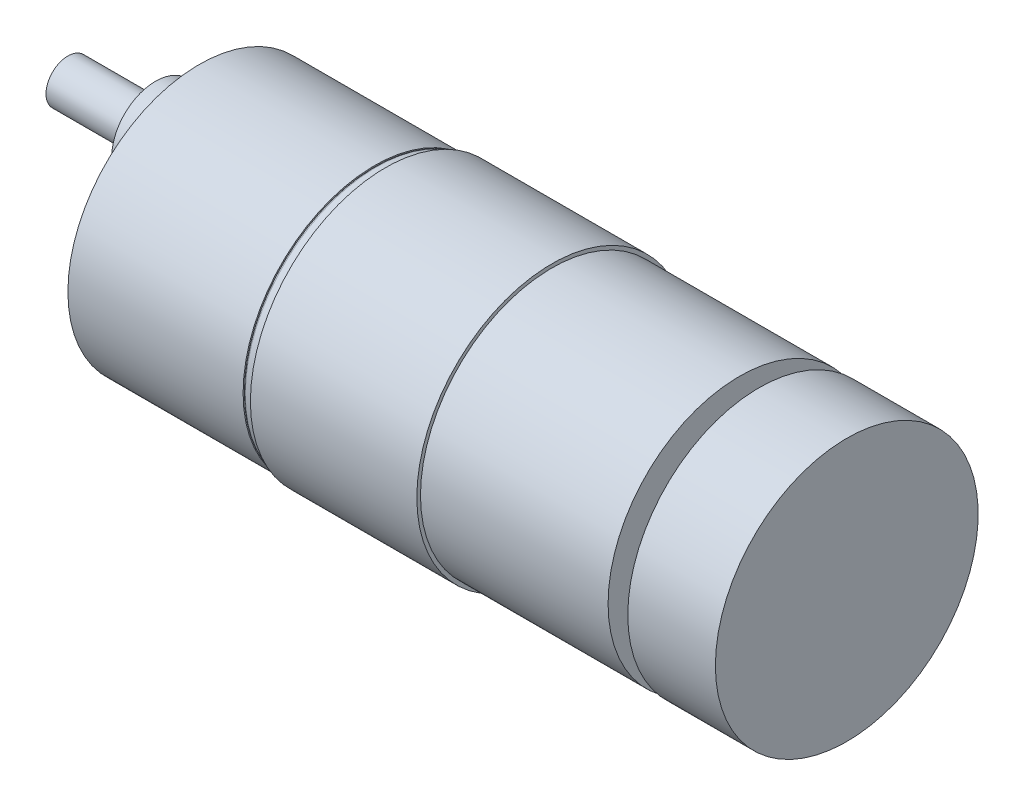
ISO-10303-21;
HEADER;
FILE_DESCRIPTION(('STEP AP214'),'2;1');
FILE_NAME('part.step','',(''),(''),'','','');
FILE_SCHEMA(('AUTOMOTIVE_DESIGN { 1 0 10303 214 1 1 1 1 }'));
ENDSEC;
DATA;
#1=APPLICATION_CONTEXT('core data for automotive mechanical design processes');
#2=APPLICATION_PROTOCOL_DEFINITION('international standard','automotive_design',2000,#1);
#3=PRODUCT_CONTEXT('',#1,'mechanical');
#4=PRODUCT('Part','Part','',(#3));
#5=PRODUCT_RELATED_PRODUCT_CATEGORY('part','',(#4));
#6=PRODUCT_DEFINITION_FORMATION('','',#4);
#7=PRODUCT_DEFINITION_CONTEXT('part definition',#1,'design');
#8=PRODUCT_DEFINITION('design','',#6,#7);
#9=PRODUCT_DEFINITION_SHAPE('','',#8);
#10=(LENGTH_UNIT() NAMED_UNIT(*) SI_UNIT(.MILLI.,.METRE.));
#11=(NAMED_UNIT(*) PLANE_ANGLE_UNIT() SI_UNIT($,.RADIAN.));
#12=(NAMED_UNIT(*) SI_UNIT($,.STERADIAN.) SOLID_ANGLE_UNIT());
#13=UNCERTAINTY_MEASURE_WITH_UNIT(LENGTH_MEASURE(1.E-05),#10,'distance_accuracy_value','');
#14=(GEOMETRIC_REPRESENTATION_CONTEXT(3) GLOBAL_UNCERTAINTY_ASSIGNED_CONTEXT((#13)) GLOBAL_UNIT_ASSIGNED_CONTEXT((#10,
#11,#12)) REPRESENTATION_CONTEXT('',''));
#15=CARTESIAN_POINT('',(0.,0.,0.));
#16=DIRECTION('',(0.,0.,1.));
#17=DIRECTION('',(1.,0.,0.));
#18=AXIS2_PLACEMENT_3D('',#15,#16,#17);
#19=CARTESIAN_POINT('',(0.,0.,0.));
#20=DIRECTION('',(1.,0.,0.));
#21=DIRECTION('',(0.,0.,-1.));
#22=AXIS2_PLACEMENT_3D('',#19,#20,#21);
#23=PLANE('',#22);
#24=CARTESIAN_POINT('',(0.,13.4233937586587,7.75000000000016));
#25=DIRECTION('',(-1.,0.,0.));
#26=DIRECTION('',(0.,0.,1.));
#27=AXIS2_PLACEMENT_3D('',#24,#25,#26);
#28=CIRCLE('',#27,1.5);
#29=CARTESIAN_POINT('',(0.,13.4233937586587,9.25000000000016));
#30=VERTEX_POINT('',#29);
#31=EDGE_CURVE('E127',#30,#30,#28,.T.);
#32=ORIENTED_EDGE('',*,*,#31,.F.);
#33=EDGE_LOOP('',(#32));
#34=FACE_BOUND('',#33,.T.);
#35=CARTESIAN_POINT('',(0.,13.4233937586589,-7.74999999999987));
#36=DIRECTION('',(-1.,0.,0.));
#37=DIRECTION('',(0.,0.,1.));
#38=AXIS2_PLACEMENT_3D('',#35,#36,#37);
#39=CIRCLE('',#38,1.5);
#40=CARTESIAN_POINT('',(0.,13.4233937586589,-6.24999999999987));
#41=VERTEX_POINT('',#40);
#42=EDGE_CURVE('E121',#41,#41,#39,.T.);
#43=ORIENTED_EDGE('',*,*,#42,.F.);
#44=EDGE_LOOP('',(#43));
#45=FACE_BOUND('',#44,.T.);
#46=CARTESIAN_POINT('',(0.,1.08235921504137E-13,-15.5));
#47=DIRECTION('',(-1.,0.,0.));
#48=DIRECTION('',(0.,0.,1.));
#49=AXIS2_PLACEMENT_3D('',#46,#47,#48);
#50=CIRCLE('',#49,1.5);
#51=CARTESIAN_POINT('',(0.,1.08235921504137E-13,-14.));
#52=VERTEX_POINT('',#51);
#53=EDGE_CURVE('E115',#52,#52,#50,.T.);
#54=ORIENTED_EDGE('',*,*,#53,.F.);
#55=EDGE_LOOP('',(#54));
#56=FACE_BOUND('',#55,.T.);
#57=CARTESIAN_POINT('',(0.,-13.4233937586588,-7.75000000000006));
#58=DIRECTION('',(-1.,0.,0.));
#59=DIRECTION('',(0.,0.,1.));
#60=AXIS2_PLACEMENT_3D('',#57,#58,#59);
#61=CIRCLE('',#60,1.5);
#62=CARTESIAN_POINT('',(0.,-13.4233937586588,-6.25000000000006));
#63=VERTEX_POINT('',#62);
#64=EDGE_CURVE('E109',#63,#63,#61,.T.);
#65=ORIENTED_EDGE('',*,*,#64,.F.);
#66=EDGE_LOOP('',(#65));
#67=FACE_BOUND('',#66,.T.);
#68=CARTESIAN_POINT('',(0.,-13.4233937586588,7.74999999999997));
#69=DIRECTION('',(-1.,0.,0.));
#70=DIRECTION('',(0.,0.,1.));
#71=AXIS2_PLACEMENT_3D('',#68,#69,#70);
#72=CIRCLE('',#71,1.5);
#73=CARTESIAN_POINT('',(0.,-13.4233937586588,9.24999999999997));
#74=VERTEX_POINT('',#73);
#75=EDGE_CURVE('E103',#74,#74,#72,.T.);
#76=ORIENTED_EDGE('',*,*,#75,.F.);
#77=EDGE_LOOP('',(#76));
#78=FACE_BOUND('',#77,.T.);
#79=CARTESIAN_POINT('',(0.,0.,15.5));
#80=DIRECTION('',(-1.,0.,0.));
#81=DIRECTION('',(0.,0.,1.));
#82=AXIS2_PLACEMENT_3D('',#79,#80,#81);
#83=CIRCLE('',#82,1.5);
#84=CARTESIAN_POINT('',(0.,0.,17.));
#85=VERTEX_POINT('',#84);
#86=EDGE_CURVE('E97',#85,#85,#83,.T.);
#87=ORIENTED_EDGE('',*,*,#86,.F.);
#88=EDGE_LOOP('',(#87));
#89=FACE_BOUND('',#88,.T.);
#90=CARTESIAN_POINT('',(0.,7.,0.));
#91=DIRECTION('',(1.,0.,0.));
#92=DIRECTION('',(0.,0.,-1.));
#93=AXIS2_PLACEMENT_3D('',#90,#91,#92);
#94=CIRCLE('',#93,6.);
#95=CARTESIAN_POINT('',(0.,7.,-6.));
#96=VERTEX_POINT('',#95);
#97=EDGE_CURVE('E10',#96,#96,#94,.F.);
#98=ORIENTED_EDGE('',*,*,#97,.F.);
#99=EDGE_LOOP('',(#98));
#100=FACE_BOUND('',#99,.T.);
#101=CARTESIAN_POINT('',(0.,0.,0.));
#102=DIRECTION('',(-1.,0.,0.));
#103=DIRECTION('',(0.,0.,1.));
#104=AXIS2_PLACEMENT_3D('',#101,#102,#103);
#105=CIRCLE('',#104,18.);
#106=CARTESIAN_POINT('',(0.,0.,18.));
#107=VERTEX_POINT('',#106);
#108=EDGE_CURVE('E44',#107,#107,#105,.T.);
#109=ORIENTED_EDGE('',*,*,#108,.T.);
#110=EDGE_LOOP('',(#109));
#111=FACE_BOUND('',#110,.T.);
#112=ADVANCED_FACE('F38',(#34,#45,#56,#67,#78,#89,#100,#111),#23,.F.);
#113=CARTESIAN_POINT('',(-65.6790909566948,0.,0.));
#114=DIRECTION('',(-1.,0.,0.));
#115=DIRECTION('',(0.,0.,1.));
#116=AXIS2_PLACEMENT_3D('',#113,#114,#115);
#117=CYLINDRICAL_SURFACE('',#116,18.);
#118=ORIENTED_EDGE('',*,*,#108,.F.);
#119=EDGE_LOOP('',(#118));
#120=FACE_BOUND('',#119,.T.);
#121=CARTESIAN_POINT('',(24.,0.,0.));
#122=DIRECTION('',(-1.,0.,0.));
#123=DIRECTION('',(0.,0.,1.));
#124=AXIS2_PLACEMENT_3D('',#121,#122,#123);
#125=CIRCLE('',#124,18.);
#126=CARTESIAN_POINT('',(24.,0.,18.));
#127=VERTEX_POINT('',#126);
#128=EDGE_CURVE('E48',#127,#127,#125,.T.);
#129=ORIENTED_EDGE('',*,*,#128,.T.);
#130=EDGE_LOOP('',(#129));
#131=FACE_BOUND('',#130,.T.);
#132=ADVANCED_FACE('F144',(#120,#131),#117,.T.);
#133=CARTESIAN_POINT('',(24.,18.,0.));
#134=DIRECTION('',(-1.,0.,0.));
#135=DIRECTION('',(0.,0.,1.));
#136=AXIS2_PLACEMENT_3D('',#133,#134,#135);
#137=PLANE('',#136);
#138=ORIENTED_EDGE('',*,*,#128,.F.);
#139=EDGE_LOOP('',(#138));
#140=FACE_BOUND('',#139,.T.);
#141=CARTESIAN_POINT('',(24.,0.,0.));
#142=DIRECTION('',(-1.,0.,0.));
#143=DIRECTION('',(0.,0.,1.));
#144=AXIS2_PLACEMENT_3D('',#141,#142,#143);
#145=CIRCLE('',#144,17.7);
#146=CARTESIAN_POINT('',(24.,0.,17.7));
#147=VERTEX_POINT('',#146);
#148=EDGE_CURVE('E52',#147,#147,#145,.T.);
#149=ORIENTED_EDGE('',*,*,#148,.T.);
#150=EDGE_LOOP('',(#149));
#151=FACE_BOUND('',#150,.T.);
#152=ADVANCED_FACE('F229',(#140,#151),#137,.F.);
#153=CARTESIAN_POINT('',(24.3,0.,0.));
#154=DIRECTION('',(-1.,0.,0.));
#155=DIRECTION('',(0.,0.,1.));
#156=AXIS2_PLACEMENT_3D('',#153,#154,#155);
#157=TOROIDAL_SURFACE('',#156,17.7,0.300000000000003);
#158=ORIENTED_EDGE('',*,*,#148,.F.);
#159=EDGE_LOOP('',(#158));
#160=FACE_BOUND('',#159,.T.);
#161=CARTESIAN_POINT('',(24.3,0.,0.));
#162=DIRECTION('',(-1.,0.,0.));
#163=DIRECTION('',(0.,0.,1.));
#164=AXIS2_PLACEMENT_3D('',#161,#162,#163);
#165=CIRCLE('',#164,18.);
#166=CARTESIAN_POINT('',(24.3,0.,18.));
#167=VERTEX_POINT('',#166);
#168=EDGE_CURVE('E57',#167,#167,#165,.T.);
#169=ORIENTED_EDGE('',*,*,#168,.T.);
#170=EDGE_LOOP('',(#169));
#171=FACE_BOUND('',#170,.T.);
#172=ADVANCED_FACE('F225',(#160,#171),#157,.T.);
#173=CARTESIAN_POINT('',(-65.6790909566948,0.,0.));
#174=DIRECTION('',(-1.,0.,0.));
#175=DIRECTION('',(0.,0.,1.));
#176=AXIS2_PLACEMENT_3D('',#173,#174,#175);
#177=CYLINDRICAL_SURFACE('',#176,18.);
#178=ORIENTED_EDGE('',*,*,#168,.F.);
#179=EDGE_LOOP('',(#178));
#180=FACE_BOUND('',#179,.T.);
#181=CARTESIAN_POINT('',(25.5,0.,0.));
#182=DIRECTION('',(-1.,0.,0.));
#183=DIRECTION('',(0.,0.,1.));
#184=AXIS2_PLACEMENT_3D('',#181,#182,#183);
#185=CIRCLE('',#184,18.);
#186=CARTESIAN_POINT('',(25.5,0.,18.));
#187=VERTEX_POINT('',#186);
#188=EDGE_CURVE('E60',#187,#187,#185,.T.);
#189=ORIENTED_EDGE('',*,*,#188,.T.);
#190=EDGE_LOOP('',(#189));
#191=FACE_BOUND('',#190,.T.);
#192=ADVANCED_FACE('F221',(#180,#191),#177,.T.);
#193=CARTESIAN_POINT('',(25.5,18.,0.));
#194=DIRECTION('',(1.,0.,0.));
#195=DIRECTION('',(0.,0.,-1.));
#196=AXIS2_PLACEMENT_3D('',#193,#194,#195);
#197=PLANE('',#196);
#198=ORIENTED_EDGE('',*,*,#188,.F.);
#199=EDGE_LOOP('',(#198));
#200=FACE_BOUND('',#199,.T.);
#201=CARTESIAN_POINT('',(25.5,0.,0.));
#202=DIRECTION('',(-1.,0.,0.));
#203=DIRECTION('',(0.,0.,1.));
#204=AXIS2_PLACEMENT_3D('',#201,#202,#203);
#205=CIRCLE('',#204,18.5);
#206=CARTESIAN_POINT('',(25.5,0.,18.5));
#207=VERTEX_POINT('',#206);
#208=EDGE_CURVE('E63',#207,#207,#205,.T.);
#209=ORIENTED_EDGE('',*,*,#208,.T.);
#210=EDGE_LOOP('',(#209));
#211=FACE_BOUND('',#210,.T.);
#212=ADVANCED_FACE('F217',(#200,#211),#197,.F.);
#213=CARTESIAN_POINT('',(-65.6790909566948,0.,0.));
#214=DIRECTION('',(-1.,0.,0.));
#215=DIRECTION('',(0.,0.,1.));
#216=AXIS2_PLACEMENT_3D('',#213,#214,#215);
#217=CYLINDRICAL_SURFACE('',#216,18.5);
#218=ORIENTED_EDGE('',*,*,#208,.F.);
#219=EDGE_LOOP('',(#218));
#220=FACE_BOUND('',#219,.T.);
#221=CARTESIAN_POINT('',(48.3,0.,0.));
#222=DIRECTION('',(-1.,0.,0.));
#223=DIRECTION('',(0.,0.,1.));
#224=AXIS2_PLACEMENT_3D('',#221,#222,#223);
#225=CIRCLE('',#224,18.5);
#226=CARTESIAN_POINT('',(48.3,0.,18.5));
#227=VERTEX_POINT('',#226);
#228=EDGE_CURVE('E66',#227,#227,#225,.T.);
#229=ORIENTED_EDGE('',*,*,#228,.T.);
#230=EDGE_LOOP('',(#229));
#231=FACE_BOUND('',#230,.T.);
#232=ADVANCED_FACE('F213',(#220,#231),#217,.T.);
#233=CARTESIAN_POINT('',(48.3,18.5,0.));
#234=DIRECTION('',(-1.,0.,0.));
#235=DIRECTION('',(0.,0.,1.));
#236=AXIS2_PLACEMENT_3D('',#233,#234,#235);
#237=PLANE('',#236);
#238=ORIENTED_EDGE('',*,*,#228,.F.);
#239=EDGE_LOOP('',(#238));
#240=FACE_BOUND('',#239,.T.);
#241=CARTESIAN_POINT('',(48.3,0.,0.));
#242=DIRECTION('',(-1.,0.,0.));
#243=DIRECTION('',(0.,0.,1.));
#244=AXIS2_PLACEMENT_3D('',#241,#242,#243);
#245=CIRCLE('',#244,18.);
#246=CARTESIAN_POINT('',(48.3,0.,18.));
#247=VERTEX_POINT('',#246);
#248=EDGE_CURVE('E69',#247,#247,#245,.T.);
#249=ORIENTED_EDGE('',*,*,#248,.T.);
#250=EDGE_LOOP('',(#249));
#251=FACE_BOUND('',#250,.T.);
#252=ADVANCED_FACE('F209',(#240,#251),#237,.F.);
#253=CARTESIAN_POINT('',(-65.6790909566948,0.,0.));
#254=DIRECTION('',(-1.,0.,0.));
#255=DIRECTION('',(0.,0.,1.));
#256=AXIS2_PLACEMENT_3D('',#253,#254,#255);
#257=CYLINDRICAL_SURFACE('',#256,18.);
#258=ORIENTED_EDGE('',*,*,#248,.F.);
#259=EDGE_LOOP('',(#258));
#260=FACE_BOUND('',#259,.T.);
#261=CARTESIAN_POINT('',(74.,0.,0.));
#262=DIRECTION('',(-1.,0.,0.));
#263=DIRECTION('',(0.,0.,1.));
#264=AXIS2_PLACEMENT_3D('',#261,#262,#263);
#265=CIRCLE('',#264,18.);
#266=CARTESIAN_POINT('',(74.,0.,18.));
#267=VERTEX_POINT('',#266);
#268=EDGE_CURVE('E72',#267,#267,#265,.T.);
#269=ORIENTED_EDGE('',*,*,#268,.T.);
#270=EDGE_LOOP('',(#269));
#271=FACE_BOUND('',#270,.T.);
#272=ADVANCED_FACE('F205',(#260,#271),#257,.T.);
#273=CARTESIAN_POINT('',(74.,18.,0.));
#274=DIRECTION('',(-1.,0.,0.));
#275=DIRECTION('',(0.,0.,1.));
#276=AXIS2_PLACEMENT_3D('',#273,#274,#275);
#277=PLANE('',#276);
#278=ORIENTED_EDGE('',*,*,#268,.F.);
#279=EDGE_LOOP('',(#278));
#280=FACE_BOUND('',#279,.T.);
#281=CARTESIAN_POINT('',(74.,0.,0.));
#282=DIRECTION('',(-1.,0.,0.));
#283=DIRECTION('',(0.,0.,1.));
#284=AXIS2_PLACEMENT_3D('',#281,#282,#283);
#285=CIRCLE('',#284,6.);
#286=CARTESIAN_POINT('',(74.,0.,6.));
#287=VERTEX_POINT('',#286);
#288=EDGE_CURVE('E75',#287,#287,#285,.T.);
#289=ORIENTED_EDGE('',*,*,#288,.T.);
#290=EDGE_LOOP('',(#289));
#291=FACE_BOUND('',#290,.T.);
#292=ADVANCED_FACE('F201',(#280,#291),#277,.F.);
#293=CARTESIAN_POINT('',(-65.6790909566948,0.,0.));
#294=DIRECTION('',(-1.,0.,0.));
#295=DIRECTION('',(0.,0.,1.));
#296=AXIS2_PLACEMENT_3D('',#293,#294,#295);
#297=CYLINDRICAL_SURFACE('',#296,6.);
#298=ORIENTED_EDGE('',*,*,#288,.F.);
#299=EDGE_LOOP('',(#298));
#300=FACE_BOUND('',#299,.T.);
#301=CARTESIAN_POINT('',(76.7,0.,0.));
#302=DIRECTION('',(-1.,0.,0.));
#303=DIRECTION('',(0.,0.,1.));
#304=AXIS2_PLACEMENT_3D('',#301,#302,#303);
#305=CIRCLE('',#304,6.);
#306=CARTESIAN_POINT('',(76.7,0.,6.));
#307=VERTEX_POINT('',#306);
#308=EDGE_CURVE('E78',#307,#307,#305,.T.);
#309=ORIENTED_EDGE('',*,*,#308,.T.);
#310=EDGE_LOOP('',(#309));
#311=FACE_BOUND('',#310,.T.);
#312=ADVANCED_FACE('F197',(#300,#311),#297,.T.);
#313=CARTESIAN_POINT('',(76.7,6.,0.));
#314=DIRECTION('',(1.,0.,0.));
#315=DIRECTION('',(0.,0.,-1.));
#316=AXIS2_PLACEMENT_3D('',#313,#314,#315);
#317=PLANE('',#316);
#318=ORIENTED_EDGE('',*,*,#308,.F.);
#319=EDGE_LOOP('',(#318));
#320=FACE_BOUND('',#319,.T.);
#321=CARTESIAN_POINT('',(76.7,0.,0.));
#322=DIRECTION('',(-1.,0.,0.));
#323=DIRECTION('',(0.,0.,1.));
#324=AXIS2_PLACEMENT_3D('',#321,#322,#323);
#325=CIRCLE('',#324,18.);
#326=CARTESIAN_POINT('',(76.7,0.,18.));
#327=VERTEX_POINT('',#326);
#328=EDGE_CURVE('E81',#327,#327,#325,.T.);
#329=ORIENTED_EDGE('',*,*,#328,.T.);
#330=EDGE_LOOP('',(#329));
#331=FACE_BOUND('',#330,.T.);
#332=ADVANCED_FACE('F193',(#320,#331),#317,.F.);
#333=CARTESIAN_POINT('',(-65.6790909566948,0.,0.));
#334=DIRECTION('',(-1.,0.,0.));
#335=DIRECTION('',(0.,0.,1.));
#336=AXIS2_PLACEMENT_3D('',#333,#334,#335);
#337=CYLINDRICAL_SURFACE('',#336,18.);
#338=ORIENTED_EDGE('',*,*,#328,.F.);
#339=EDGE_LOOP('',(#338));
#340=FACE_BOUND('',#339,.T.);
#341=CARTESIAN_POINT('',(88.7,0.,0.));
#342=DIRECTION('',(-1.,0.,0.));
#343=DIRECTION('',(0.,0.,1.));
#344=AXIS2_PLACEMENT_3D('',#341,#342,#343);
#345=CIRCLE('',#344,18.);
#346=CARTESIAN_POINT('',(88.7,0.,18.));
#347=VERTEX_POINT('',#346);
#348=EDGE_CURVE('E84',#347,#347,#345,.T.);
#349=ORIENTED_EDGE('',*,*,#348,.T.);
#350=EDGE_LOOP('',(#349));
#351=FACE_BOUND('',#350,.T.);
#352=ADVANCED_FACE('F189',(#340,#351),#337,.T.);
#353=CARTESIAN_POINT('',(88.7,18.,0.));
#354=DIRECTION('',(-1.,0.,0.));
#355=DIRECTION('',(0.,0.,1.));
#356=AXIS2_PLACEMENT_3D('',#353,#354,#355);
#357=PLANE('',#356);
#358=ORIENTED_EDGE('',*,*,#348,.F.);
#359=EDGE_LOOP('',(#358));
#360=FACE_BOUND('',#359,.T.);
#361=ADVANCED_FACE('F185',(#360),#357,.F.);
#362=CARTESIAN_POINT('',(-6.,7.,0.));
#363=DIRECTION('',(1.,0.,0.));
#364=DIRECTION('',(0.,0.,-1.));
#365=AXIS2_PLACEMENT_3D('',#362,#363,#364);
#366=CYLINDRICAL_SURFACE('',#365,6.);
#367=CARTESIAN_POINT('',(-6.,7.,0.));
#368=DIRECTION('',(-1.,0.,0.));
#369=DIRECTION('',(0.,0.,1.));
#370=AXIS2_PLACEMENT_3D('',#367,#368,#369);
#371=CIRCLE('',#370,6.);
#372=CARTESIAN_POINT('',(-6.,7.,6.));
#373=VERTEX_POINT('',#372);
#374=EDGE_CURVE('E87',#373,#373,#371,.T.);
#375=ORIENTED_EDGE('',*,*,#374,.F.);
#376=EDGE_LOOP('',(#375));
#377=FACE_BOUND('',#376,.T.);
#378=ORIENTED_EDGE('',*,*,#97,.T.);
#379=EDGE_LOOP('',(#378));
#380=FACE_BOUND('',#379,.T.);
#381=ADVANCED_FACE('F181',(#377,#380),#366,.T.);
#382=CARTESIAN_POINT('',(-6.,7.,0.));
#383=DIRECTION('',(-1.,0.,0.));
#384=DIRECTION('',(0.,0.,1.));
#385=AXIS2_PLACEMENT_3D('',#382,#383,#384);
#386=PLANE('',#385);
#387=CARTESIAN_POINT('',(-6.,7.,0.));
#388=DIRECTION('',(-1.,0.,0.));
#389=DIRECTION('',(0.,0.,1.));
#390=AXIS2_PLACEMENT_3D('',#387,#388,#389);
#391=CIRCLE('',#390,3.);
#392=CARTESIAN_POINT('',(-6.,7.,3.));
#393=VERTEX_POINT('',#392);
#394=EDGE_CURVE('E91',#393,#393,#391,.T.);
#395=ORIENTED_EDGE('',*,*,#394,.F.);
#396=EDGE_LOOP('',(#395));
#397=FACE_BOUND('',#396,.T.);
#398=ORIENTED_EDGE('',*,*,#374,.T.);
#399=EDGE_LOOP('',(#398));
#400=FACE_BOUND('',#399,.T.);
#401=ADVANCED_FACE('F177',(#397,#400),#386,.T.);
#402=CARTESIAN_POINT('',(-18.,7.,0.));
#403=DIRECTION('',(1.,0.,0.));
#404=DIRECTION('',(0.,0.,-1.));
#405=AXIS2_PLACEMENT_3D('',#402,#403,#404);
#406=CYLINDRICAL_SURFACE('',#405,3.);
#407=CARTESIAN_POINT('',(-18.,7.,0.));
#408=DIRECTION('',(-1.,0.,0.));
#409=DIRECTION('',(0.,0.,1.));
#410=AXIS2_PLACEMENT_3D('',#407,#408,#409);
#411=CIRCLE('',#410,3.);
#412=CARTESIAN_POINT('',(-18.,7.,3.));
#413=VERTEX_POINT('',#412);
#414=EDGE_CURVE('E90',#413,#413,#411,.T.);
#415=ORIENTED_EDGE('',*,*,#414,.F.);
#416=EDGE_LOOP('',(#415));
#417=FACE_BOUND('',#416,.T.);
#418=ORIENTED_EDGE('',*,*,#394,.T.);
#419=EDGE_LOOP('',(#418));
#420=FACE_BOUND('',#419,.T.);
#421=ADVANCED_FACE('F169',(#417,#420),#406,.T.);
#422=CARTESIAN_POINT('',(-18.,7.,0.));
#423=DIRECTION('',(-1.,0.,0.));
#424=DIRECTION('',(0.,0.,1.));
#425=AXIS2_PLACEMENT_3D('',#422,#423,#424);
#426=PLANE('',#425);
#427=ORIENTED_EDGE('',*,*,#414,.T.);
#428=EDGE_LOOP('',(#427));
#429=FACE_BOUND('',#428,.T.);
#430=ADVANCED_FACE('F159',(#429),#426,.T.);
#431=CARTESIAN_POINT('',(12.,0.,15.5));
#432=DIRECTION('',(-1.,0.,0.));
#433=DIRECTION('',(0.,0.,1.));
#434=AXIS2_PLACEMENT_3D('',#431,#432,#433);
#435=CYLINDRICAL_SURFACE('',#434,1.5);
#436=CARTESIAN_POINT('',(12.,0.,15.5));
#437=DIRECTION('',(-1.,0.,0.));
#438=DIRECTION('',(0.,0.,1.));
#439=AXIS2_PLACEMENT_3D('',#436,#437,#438);
#440=CIRCLE('',#439,1.5);
#441=CARTESIAN_POINT('',(12.,0.,17.));
#442=VERTEX_POINT('',#441);
#443=EDGE_CURVE('E94',#442,#442,#440,.T.);
#444=ORIENTED_EDGE('',*,*,#443,.F.);
#445=EDGE_LOOP('',(#444));
#446=FACE_BOUND('',#445,.T.);
#447=ORIENTED_EDGE('',*,*,#86,.T.);
#448=EDGE_LOOP('',(#447));
#449=FACE_BOUND('',#448,.T.);
#450=ADVANCED_FACE('F156',(#446,#449),#435,.F.);
#451=CARTESIAN_POINT('',(12.,0.,15.5));
#452=DIRECTION('',(-1.,0.,0.));
#453=DIRECTION('',(0.,0.,1.));
#454=AXIS2_PLACEMENT_3D('',#451,#452,#453);
#455=PLANE('',#454);
#456=ORIENTED_EDGE('',*,*,#443,.T.);
#457=EDGE_LOOP('',(#456));
#458=FACE_BOUND('',#457,.T.);
#459=ADVANCED_FACE('F158',(#458),#455,.T.);
#460=CARTESIAN_POINT('',(12.,-13.4233937586588,7.74999999999997));
#461=DIRECTION('',(-1.,0.,0.));
#462=DIRECTION('',(0.,0.,1.));
#463=AXIS2_PLACEMENT_3D('',#460,#461,#462);
#464=CYLINDRICAL_SURFACE('',#463,1.5);
#465=CARTESIAN_POINT('',(12.,-13.4233937586588,7.74999999999997));
#466=DIRECTION('',(-1.,0.,0.));
#467=DIRECTION('',(0.,0.,1.));
#468=AXIS2_PLACEMENT_3D('',#465,#466,#467);
#469=CIRCLE('',#468,1.5);
#470=CARTESIAN_POINT('',(12.,-13.4233937586588,9.24999999999997));
#471=VERTEX_POINT('',#470);
#472=EDGE_CURVE('E100',#471,#471,#469,.T.);
#473=ORIENTED_EDGE('',*,*,#472,.F.);
#474=EDGE_LOOP('',(#473));
#475=FACE_BOUND('',#474,.T.);
#476=ORIENTED_EDGE('',*,*,#75,.T.);
#477=EDGE_LOOP('',(#476));
#478=FACE_BOUND('',#477,.T.);
#479=ADVANCED_FACE('F166',(#475,#478),#464,.F.);
#480=CARTESIAN_POINT('',(12.,-13.4233937586588,7.74999999999997));
#481=DIRECTION('',(-1.,0.,0.));
#482=DIRECTION('',(0.,0.,1.));
#483=AXIS2_PLACEMENT_3D('',#480,#481,#482);
#484=PLANE('',#483);
#485=ORIENTED_EDGE('',*,*,#472,.T.);
#486=EDGE_LOOP('',(#485));
#487=FACE_BOUND('',#486,.T.);
#488=ADVANCED_FACE('F354',(#487),#484,.T.);
#489=CARTESIAN_POINT('',(12.,-13.4233937586588,-7.75000000000006));
#490=DIRECTION('',(-1.,0.,0.));
#491=DIRECTION('',(0.,0.,1.));
#492=AXIS2_PLACEMENT_3D('',#489,#490,#491);
#493=CYLINDRICAL_SURFACE('',#492,1.5);
#494=CARTESIAN_POINT('',(12.,-13.4233937586588,-7.75000000000006));
#495=DIRECTION('',(-1.,0.,0.));
#496=DIRECTION('',(0.,0.,1.));
#497=AXIS2_PLACEMENT_3D('',#494,#495,#496);
#498=CIRCLE('',#497,1.5);
#499=CARTESIAN_POINT('',(12.,-13.4233937586588,-6.25000000000006));
#500=VERTEX_POINT('',#499);
#501=EDGE_CURVE('E106',#500,#500,#498,.T.);
#502=ORIENTED_EDGE('',*,*,#501,.F.);
#503=EDGE_LOOP('',(#502));
#504=FACE_BOUND('',#503,.T.);
#505=ORIENTED_EDGE('',*,*,#64,.T.);
#506=EDGE_LOOP('',(#505));
#507=FACE_BOUND('',#506,.T.);
#508=ADVANCED_FACE('F363',(#504,#507),#493,.F.);
#509=CARTESIAN_POINT('',(12.,-13.4233937586588,-7.75000000000006));
#510=DIRECTION('',(-1.,0.,0.));
#511=DIRECTION('',(0.,0.,1.));
#512=AXIS2_PLACEMENT_3D('',#509,#510,#511);
#513=PLANE('',#512);
#514=ORIENTED_EDGE('',*,*,#501,.T.);
#515=EDGE_LOOP('',(#514));
#516=FACE_BOUND('',#515,.T.);
#517=ADVANCED_FACE('F373',(#516),#513,.T.);
#518=CARTESIAN_POINT('',(12.,1.08235921504137E-13,-15.5));
#519=DIRECTION('',(-1.,0.,0.));
#520=DIRECTION('',(0.,0.,1.));
#521=AXIS2_PLACEMENT_3D('',#518,#519,#520);
#522=CYLINDRICAL_SURFACE('',#521,1.5);
#523=CARTESIAN_POINT('',(12.,1.08235921504137E-13,-15.5));
#524=DIRECTION('',(-1.,0.,0.));
#525=DIRECTION('',(0.,0.,1.));
#526=AXIS2_PLACEMENT_3D('',#523,#524,#525);
#527=CIRCLE('',#526,1.5);
#528=CARTESIAN_POINT('',(12.,1.08235921504137E-13,-14.));
#529=VERTEX_POINT('',#528);
#530=EDGE_CURVE('E112',#529,#529,#527,.T.);
#531=ORIENTED_EDGE('',*,*,#530,.F.);
#532=EDGE_LOOP('',(#531));
#533=FACE_BOUND('',#532,.T.);
#534=ORIENTED_EDGE('',*,*,#53,.T.);
#535=EDGE_LOOP('',(#534));
#536=FACE_BOUND('',#535,.T.);
#537=ADVANCED_FACE('F383',(#533,#536),#522,.F.);
#538=CARTESIAN_POINT('',(12.,1.08235921504137E-13,-15.5));
#539=DIRECTION('',(-1.,0.,0.));
#540=DIRECTION('',(0.,0.,1.));
#541=AXIS2_PLACEMENT_3D('',#538,#539,#540);
#542=PLANE('',#541);
#543=ORIENTED_EDGE('',*,*,#530,.T.);
#544=EDGE_LOOP('',(#543));
#545=FACE_BOUND('',#544,.T.);
#546=ADVANCED_FACE('F393',(#545),#542,.T.);
#547=CARTESIAN_POINT('',(12.,13.4233937586589,-7.74999999999987));
#548=DIRECTION('',(-1.,0.,0.));
#549=DIRECTION('',(0.,0.,1.));
#550=AXIS2_PLACEMENT_3D('',#547,#548,#549);
#551=CYLINDRICAL_SURFACE('',#550,1.5);
#552=CARTESIAN_POINT('',(12.,13.4233937586589,-7.74999999999987));
#553=DIRECTION('',(-1.,0.,0.));
#554=DIRECTION('',(0.,0.,1.));
#555=AXIS2_PLACEMENT_3D('',#552,#553,#554);
#556=CIRCLE('',#555,1.5);
#557=CARTESIAN_POINT('',(12.,13.4233937586589,-6.24999999999987));
#558=VERTEX_POINT('',#557);
#559=EDGE_CURVE('E118',#558,#558,#556,.T.);
#560=ORIENTED_EDGE('',*,*,#559,.F.);
#561=EDGE_LOOP('',(#560));
#562=FACE_BOUND('',#561,.T.);
#563=ORIENTED_EDGE('',*,*,#42,.T.);
#564=EDGE_LOOP('',(#563));
#565=FACE_BOUND('',#564,.T.);
#566=ADVANCED_FACE('F403',(#562,#565),#551,.F.);
#567=CARTESIAN_POINT('',(12.,13.4233937586589,-7.74999999999987));
#568=DIRECTION('',(-1.,0.,0.));
#569=DIRECTION('',(0.,0.,1.));
#570=AXIS2_PLACEMENT_3D('',#567,#568,#569);
#571=PLANE('',#570);
#572=ORIENTED_EDGE('',*,*,#559,.T.);
#573=EDGE_LOOP('',(#572));
#574=FACE_BOUND('',#573,.T.);
#575=ADVANCED_FACE('F138',(#574),#571,.T.);
#576=CARTESIAN_POINT('',(12.,13.4233937586587,7.75000000000016));
#577=DIRECTION('',(-1.,0.,0.));
#578=DIRECTION('',(0.,0.,1.));
#579=AXIS2_PLACEMENT_3D('',#576,#577,#578);
#580=CYLINDRICAL_SURFACE('',#579,1.5);
#581=CARTESIAN_POINT('',(12.,13.4233937586587,7.75000000000016));
#582=DIRECTION('',(-1.,0.,0.));
#583=DIRECTION('',(0.,0.,1.));
#584=AXIS2_PLACEMENT_3D('',#581,#582,#583);
#585=CIRCLE('',#584,1.5);
#586=CARTESIAN_POINT('',(12.,13.4233937586587,9.25000000000016));
#587=VERTEX_POINT('',#586);
#588=EDGE_CURVE('E124',#587,#587,#585,.T.);
#589=ORIENTED_EDGE('',*,*,#588,.F.);
#590=EDGE_LOOP('',(#589));
#591=FACE_BOUND('',#590,.T.);
#592=ORIENTED_EDGE('',*,*,#31,.T.);
#593=EDGE_LOOP('',(#592));
#594=FACE_BOUND('',#593,.T.);
#595=ADVANCED_FACE('F135',(#591,#594),#580,.F.);
#596=CARTESIAN_POINT('',(12.,13.4233937586587,7.75000000000016));
#597=DIRECTION('',(-1.,0.,0.));
#598=DIRECTION('',(0.,0.,1.));
#599=AXIS2_PLACEMENT_3D('',#596,#597,#598);
#600=PLANE('',#599);
#601=ORIENTED_EDGE('',*,*,#588,.T.);
#602=EDGE_LOOP('',(#601));
#603=FACE_BOUND('',#602,.T.);
#604=ADVANCED_FACE('F133',(#603),#600,.T.);
#605=CLOSED_SHELL('',(#112,#132,#152,#172,#192,#212,#232,#252,#272,#292,#312,#332,#352,#361,
#381,#401,#421,#430,#450,#459,#479,#488,#508,#517,#537,#546,#566,#575,#595,#604));
#606=MANIFOLD_SOLID_BREP('B2',#605);
#607=ADVANCED_BREP_SHAPE_REPRESENTATION('',(#18,#606),#14);
#608=SHAPE_DEFINITION_REPRESENTATION(#9,#607);
ENDSEC;
END-ISO-10303-21;
